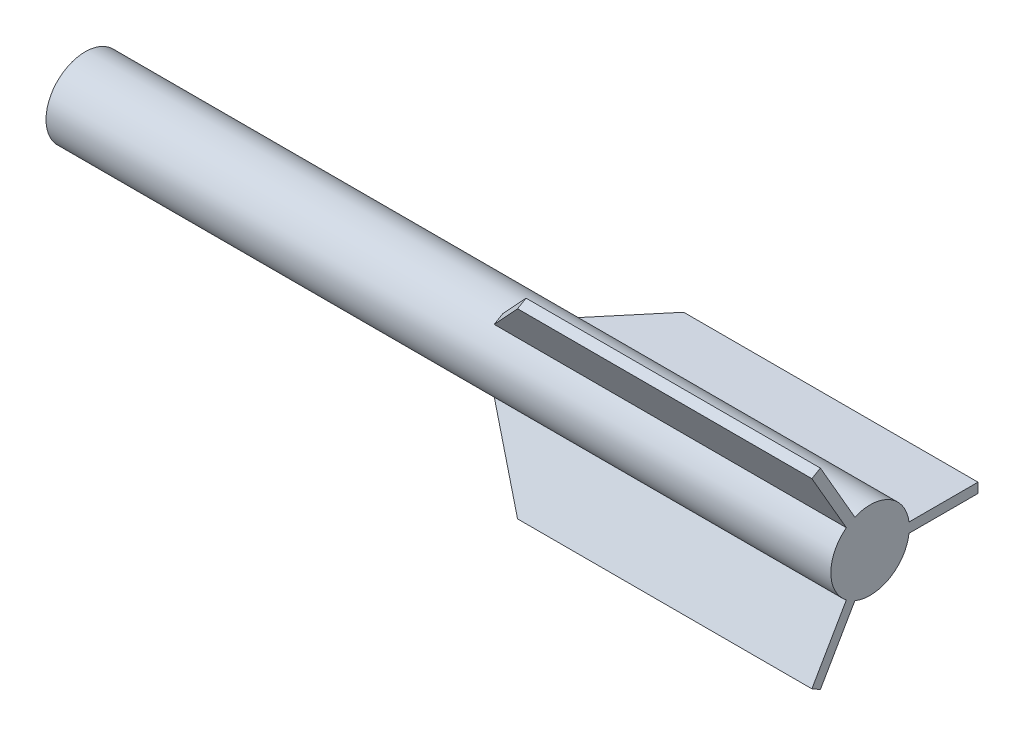
ISO-10303-21;
HEADER;
FILE_DESCRIPTION(('STEP AP214'),'2;1');
FILE_NAME('part.step','',(''),(''),'','','');
FILE_SCHEMA(('AUTOMOTIVE_DESIGN { 1 0 10303 214 1 1 1 1 }'));
ENDSEC;
DATA;
#1=APPLICATION_CONTEXT('core data for automotive mechanical design processes');
#2=APPLICATION_PROTOCOL_DEFINITION('international standard','automotive_design',2000,#1);
#3=PRODUCT_CONTEXT('',#1,'mechanical');
#4=PRODUCT('Part','Part','',(#3));
#5=PRODUCT_RELATED_PRODUCT_CATEGORY('part','',(#4));
#6=PRODUCT_DEFINITION_FORMATION('','',#4);
#7=PRODUCT_DEFINITION_CONTEXT('part definition',#1,'design');
#8=PRODUCT_DEFINITION('design','',#6,#7);
#9=PRODUCT_DEFINITION_SHAPE('','',#8);
#10=(LENGTH_UNIT() NAMED_UNIT(*) SI_UNIT(.MILLI.,.METRE.));
#11=(NAMED_UNIT(*) PLANE_ANGLE_UNIT() SI_UNIT($,.RADIAN.));
#12=(NAMED_UNIT(*) SI_UNIT($,.STERADIAN.) SOLID_ANGLE_UNIT());
#13=UNCERTAINTY_MEASURE_WITH_UNIT(LENGTH_MEASURE(1.E-05),#10,'distance_accuracy_value','');
#14=(GEOMETRIC_REPRESENTATION_CONTEXT(3) GLOBAL_UNCERTAINTY_ASSIGNED_CONTEXT((#13)) GLOBAL_UNIT_ASSIGNED_CONTEXT((#10,
#11,#12)) REPRESENTATION_CONTEXT('',''));
#15=CARTESIAN_POINT('',(0.,0.,0.));
#16=DIRECTION('',(0.,0.,1.));
#17=DIRECTION('',(1.,0.,0.));
#18=AXIS2_PLACEMENT_3D('',#15,#16,#17);
#19=CARTESIAN_POINT('',(94.9963700626207,0.,-20.));
#20=DIRECTION('',(-1.,0.,0.));
#21=DIRECTION('',(0.,0.,1.));
#22=AXIS2_PLACEMENT_3D('',#19,#20,#21);
#23=PLANE('',#22);
#24=CARTESIAN_POINT('',(94.9963700626207,0.,0.));
#25=DIRECTION('',(-1.,0.,0.));
#26=DIRECTION('',(0.,0.,1.));
#27=AXIS2_PLACEMENT_3D('',#24,#25,#26);
#28=CIRCLE('',#27,20.);
#29=CARTESIAN_POINT('',(94.9963700626207,18.4346588560844,7.75650390703121));
#30=VERTEX_POINT('',#29);
#31=CARTESIAN_POINT('',(94.9963700626207,2.5,-19.8431348329844));
#32=VERTEX_POINT('',#31);
#33=EDGE_CURVE('E228',#30,#32,#28,.T.);
#34=ORIENTED_EDGE('',*,*,#33,.F.);
#35=DIRECTION('',(0.,0.866025403784436,0.500000000000004));
#36=VECTOR('',#35,1.);
#37=CARTESIAN_POINT('',(94.9963700626207,-13.4927332971333,-10.676784547152));
#38=LINE('',#37,#36);
#39=CARTESIAN_POINT('',(94.9963700626207,48.881397208144,25.3349364905392));
#40=VERTEX_POINT('',#39);
#41=EDGE_CURVE('E153',#40,#30,#38,.F.);
#42=ORIENTED_EDGE('',*,*,#41,.F.);
#43=DIRECTION('',(0.,0.500000000000004,-0.866025403784436));
#44=VECTOR('',#43,1.);
#45=CARTESIAN_POINT('',(94.9963700626207,47.631397208144,27.5000000000002));
#46=LINE('',#45,#44);
#47=CARTESIAN_POINT('',(94.9963700626207,46.381397208144,29.6650635094613));
#48=VERTEX_POINT('',#47);
#49=EDGE_CURVE('E149',#48,#40,#46,.T.);
#50=ORIENTED_EDGE('',*,*,#49,.F.);
#51=DIRECTION('',(0.,0.866025403784436,0.500000000000004));
#52=VECTOR('',#51,1.);
#53=CARTESIAN_POINT('',(94.9963700626207,-15.9927332971334,-6.34665752822981));
#54=LINE('',#53,#52);
#55=CARTESIAN_POINT('',(94.9963700626207,15.9346588560844,12.0866309259534));
#56=VERTEX_POINT('',#55);
#57=EDGE_CURVE('E137',#48,#56,#54,.F.);
#58=ORIENTED_EDGE('',*,*,#57,.T.);
#59=CARTESIAN_POINT('',(94.9963700626207,-15.9346588560843,12.0866309259534));
#60=VERTEX_POINT('',#59);
#61=EDGE_CURVE('E233',#60,#56,#28,.T.);
#62=ORIENTED_EDGE('',*,*,#61,.F.);
#63=DIRECTION('',(0.,-0.866025403784436,0.500000000000004));
#64=VECTOR('',#63,1.);
#65=CARTESIAN_POINT('',(94.9963700626208,7.58453047896096,-1.49217936775693));
#66=LINE('',#65,#64);
#67=CARTESIAN_POINT('',(94.9963700626208,-46.381397208144,29.6650635094613));
#68=VERTEX_POINT('',#67);
#69=EDGE_CURVE('E175',#68,#60,#66,.F.);
#70=ORIENTED_EDGE('',*,*,#69,.F.);
#71=DIRECTION('',(0.,0.500000000000004,0.866025403784436));
#72=VECTOR('',#71,1.);
#73=CARTESIAN_POINT('',(94.9963700626207,-47.631397208144,27.5000000000002));
#74=LINE('',#73,#72);
#75=CARTESIAN_POINT('',(94.9963700626208,-48.881397208144,25.3349364905391));
#76=VERTEX_POINT('',#75);
#77=EDGE_CURVE('E183',#76,#68,#74,.T.);
#78=ORIENTED_EDGE('',*,*,#77,.F.);
#79=DIRECTION('',(0.,-0.866025403784436,0.500000000000004));
#80=VECTOR('',#79,1.);
#81=CARTESIAN_POINT('',(94.9963700626208,5.08453047896093,-5.82230638667912));
#82=LINE('',#81,#80);
#83=CARTESIAN_POINT('',(94.9963700626208,-18.4346588560844,7.75650390703121));
#84=VERTEX_POINT('',#83);
#85=EDGE_CURVE('E179',#76,#84,#82,.F.);
#86=ORIENTED_EDGE('',*,*,#85,.T.);
#87=CARTESIAN_POINT('',(94.9963700626207,-2.5,-19.8431348329844));
#88=VERTEX_POINT('',#87);
#89=EDGE_CURVE('E229',#88,#84,#28,.T.);
#90=ORIENTED_EDGE('',*,*,#89,.F.);
#91=DIRECTION('',(0.,0.,1.));
#92=VECTOR('',#91,1.);
#93=CARTESIAN_POINT('',(94.9963700626207,-2.5,-0.949587389404511));
#94=LINE('',#93,#92);
#95=CARTESIAN_POINT('',(94.9963700626207,-2.5,-55.));
#96=VERTEX_POINT('',#95);
#97=EDGE_CURVE('E205',#88,#96,#94,.F.);
#98=ORIENTED_EDGE('',*,*,#97,.T.);
#99=DIRECTION('',(0.,1.,0.));
#100=VECTOR('',#99,1.);
#101=CARTESIAN_POINT('',(94.9963700626207,0.,-55.));
#102=LINE('',#101,#100);
#103=CARTESIAN_POINT('',(94.9963700626207,2.5,-55.));
#104=VERTEX_POINT('',#103);
#105=EDGE_CURVE('E224',#96,#104,#102,.T.);
#106=ORIENTED_EDGE('',*,*,#105,.T.);
#107=DIRECTION('',(0.,0.,1.));
#108=VECTOR('',#107,1.);
#109=CARTESIAN_POINT('',(94.9963700626207,2.5,-0.949587389404511));
#110=LINE('',#109,#108);
#111=EDGE_CURVE('E209',#32,#104,#110,.F.);
#112=ORIENTED_EDGE('',*,*,#111,.F.);
#113=EDGE_LOOP('',(#34,#42,#50,#58,#62,#70,#78,#86,#90,#98,#106,#112));
#114=FACE_BOUND('',#113,.T.);
#115=ADVANCED_FACE('F43',(#114),#23,.F.);
#116=CARTESIAN_POINT('',(-305.003629937379,0.,0.));
#117=DIRECTION('',(1.,0.,0.));
#118=DIRECTION('',(0.,0.,-1.));
#119=AXIS2_PLACEMENT_3D('',#116,#117,#118);
#120=PLANE('',#119);
#121=CARTESIAN_POINT('',(-305.003629937379,0.,0.));
#122=DIRECTION('',(-1.,0.,0.));
#123=DIRECTION('',(0.,0.,1.));
#124=AXIS2_PLACEMENT_3D('',#121,#122,#123);
#125=CIRCLE('',#124,17.5);
#126=CARTESIAN_POINT('',(-305.003629937379,0.,17.5));
#127=VERTEX_POINT('',#126);
#128=EDGE_CURVE('E440',#127,#127,#125,.T.);
#129=ORIENTED_EDGE('',*,*,#128,.F.);
#130=EDGE_LOOP('',(#129));
#131=FACE_BOUND('',#130,.T.);
#132=CARTESIAN_POINT('',(-305.003629937379,0.,0.));
#133=DIRECTION('',(-1.,0.,0.));
#134=DIRECTION('',(0.,0.,1.));
#135=AXIS2_PLACEMENT_3D('',#132,#133,#134);
#136=CIRCLE('',#135,20.);
#137=CARTESIAN_POINT('',(-305.003629937379,0.,20.));
#138=VERTEX_POINT('',#137);
#139=EDGE_CURVE('E232',#138,#138,#136,.T.);
#140=ORIENTED_EDGE('',*,*,#139,.T.);
#141=EDGE_LOOP('',(#140));
#142=FACE_BOUND('',#141,.T.);
#143=ADVANCED_FACE('F294',(#131,#142),#120,.F.);
#144=CARTESIAN_POINT('',(-128.010899182561,0.,0.));
#145=DIRECTION('',(-1.,0.,0.));
#146=DIRECTION('',(0.,0.,1.));
#147=AXIS2_PLACEMENT_3D('',#144,#145,#146);
#148=CYLINDRICAL_SURFACE('',#147,20.);
#149=ORIENTED_EDGE('',*,*,#89,.T.);
#150=DIRECTION('',(-1.,0.,0.));
#151=VECTOR('',#150,1.);
#152=CARTESIAN_POINT('',(-128.010899182561,-18.4346588560844,7.75650390703121));
#153=LINE('',#152,#151);
#154=CARTESIAN_POINT('',(-84.5037425323713,-18.4346588560844,7.75650390703121));
#155=VERTEX_POINT('',#154);
#156=EDGE_CURVE('E247',#155,#84,#153,.F.);
#157=ORIENTED_EDGE('',*,*,#156,.F.);
#158=CARTESIAN_POINT('',(-101.15410965213,0.,0.));
#159=DIRECTION('',(-0.766044443118979,-0.556670399226416,0.321393804843271));
#160=DIRECTION('',(-0.642787609686538,0.663413948168938,-0.383022221559493));
#161=AXIS2_PLACEMENT_3D('',#158,#159,#160);
#162=ELLIPSE('',#161,26.1081457866455,20.);
#163=CARTESIAN_POINT('',(-84.5037425323713,-15.9346588560843,12.0866309259534));
#164=VERTEX_POINT('',#163);
#165=EDGE_CURVE('E251',#155,#164,#162,.T.);
#166=ORIENTED_EDGE('',*,*,#165,.T.);
#167=DIRECTION('',(-1.,0.,0.));
#168=VECTOR('',#167,1.);
#169=CARTESIAN_POINT('',(-128.010899182561,-15.9346588560843,12.0866309259534));
#170=LINE('',#169,#168);
#171=EDGE_CURVE('E254',#164,#60,#170,.F.);
#172=ORIENTED_EDGE('',*,*,#171,.T.);
#173=ORIENTED_EDGE('',*,*,#61,.T.);
#174=DIRECTION('',(-1.,0.,0.));
#175=VECTOR('',#174,1.);
#176=CARTESIAN_POINT('',(-128.010899182561,15.9346588560843,12.0866309259534));
#177=LINE('',#176,#175);
#178=CARTESIAN_POINT('',(-84.5037425323713,15.9346588560843,12.0866309259534));
#179=VERTEX_POINT('',#178);
#180=EDGE_CURVE('E61',#179,#56,#177,.F.);
#181=ORIENTED_EDGE('',*,*,#180,.F.);
#182=CARTESIAN_POINT('',(-101.15410965213,0.,0.));
#183=DIRECTION('',(-0.76604444311898,0.556670399226416,0.321393804843271));
#184=DIRECTION('',(-0.642787609686537,-0.663413948168938,-0.383022221559493));
#185=AXIS2_PLACEMENT_3D('',#182,#183,#184);
#186=ELLIPSE('',#185,26.1081457866455,20.);
#187=CARTESIAN_POINT('',(-84.5037425323713,18.4346588560844,7.75650390703121));
#188=VERTEX_POINT('',#187);
#189=EDGE_CURVE('E51',#179,#188,#186,.T.);
#190=ORIENTED_EDGE('',*,*,#189,.T.);
#191=DIRECTION('',(-1.,0.,0.));
#192=VECTOR('',#191,1.);
#193=CARTESIAN_POINT('',(-128.010899182561,18.4346588560844,7.75650390703121));
#194=LINE('',#193,#192);
#195=EDGE_CURVE('E11',#188,#30,#194,.F.);
#196=ORIENTED_EDGE('',*,*,#195,.T.);
#197=ORIENTED_EDGE('',*,*,#33,.T.);
#198=DIRECTION('',(-1.,0.,0.));
#199=VECTOR('',#198,1.);
#200=CARTESIAN_POINT('',(-128.010899182561,2.5,-19.8431348329844));
#201=LINE('',#200,#199);
#202=CARTESIAN_POINT('',(-84.5037425323712,2.5,-19.8431348329844));
#203=VERTEX_POINT('',#202);
#204=EDGE_CURVE('E241',#32,#203,#201,.T.);
#205=ORIENTED_EDGE('',*,*,#204,.T.);
#206=CARTESIAN_POINT('',(-101.154109652129,0.,0.));
#207=DIRECTION('',(-0.76604444311898,0.,-0.642787609686537));
#208=DIRECTION('',(-0.642787609686537,0.,0.76604444311898));
#209=AXIS2_PLACEMENT_3D('',#206,#207,#208);
#210=ELLIPSE('',#209,26.1081457866455,20.);
#211=CARTESIAN_POINT('',(-84.5037425323712,-2.5,-19.8431348329844));
#212=VERTEX_POINT('',#211);
#213=EDGE_CURVE('E238',#203,#212,#210,.T.);
#214=ORIENTED_EDGE('',*,*,#213,.T.);
#215=DIRECTION('',(-1.,0.,0.));
#216=VECTOR('',#215,1.);
#217=CARTESIAN_POINT('',(-128.010899182561,-2.5,-19.8431348329844));
#218=LINE('',#217,#216);
#219=EDGE_CURVE('E237',#88,#212,#218,.T.);
#220=ORIENTED_EDGE('',*,*,#219,.F.);
#221=EDGE_LOOP('',(#149,#157,#166,#172,#173,#181,#190,#196,#197,#205,#214,#220));
#222=FACE_BOUND('',#221,.T.);
#223=ORIENTED_EDGE('',*,*,#139,.F.);
#224=EDGE_LOOP('',(#223));
#225=FACE_BOUND('',#224,.T.);
#226=ADVANCED_FACE('F263',(#222,#225),#148,.T.);
#227=CARTESIAN_POINT('',(-55.0036299373793,0.,-55.));
#228=DIRECTION('',(-0.76604444311898,0.,-0.642787609686537));
#229=DIRECTION('',(-0.642787609686537,0.,0.76604444311898));
#230=AXIS2_PLACEMENT_3D('',#227,#228,#229);
#231=PLANE('',#230);
#232=ORIENTED_EDGE('',*,*,#213,.F.);
#233=DIRECTION('',(-0.642787609686537,0.,0.76604444311898));
#234=VECTOR('',#233,1.);
#235=CARTESIAN_POINT('',(-55.0036299373793,2.5,-55.));
#236=LINE('',#235,#234);
#237=CARTESIAN_POINT('',(-55.0036299373793,2.5,-55.));
#238=VERTEX_POINT('',#237);
#239=EDGE_CURVE('E200',#238,#203,#236,.T.);
#240=ORIENTED_EDGE('',*,*,#239,.F.);
#241=DIRECTION('',(0.,1.,0.));
#242=VECTOR('',#241,1.);
#243=CARTESIAN_POINT('',(-55.0036299373793,0.,-55.));
#244=LINE('',#243,#242);
#245=CARTESIAN_POINT('',(-55.0036299373793,-2.5,-55.));
#246=VERTEX_POINT('',#245);
#247=EDGE_CURVE('E212',#246,#238,#244,.T.);
#248=ORIENTED_EDGE('',*,*,#247,.F.);
#249=DIRECTION('',(-0.642787609686537,0.,0.76604444311898));
#250=VECTOR('',#249,1.);
#251=CARTESIAN_POINT('',(-55.0036299373793,-2.5,-55.));
#252=LINE('',#251,#250);
#253=EDGE_CURVE('E197',#246,#212,#252,.T.);
#254=ORIENTED_EDGE('',*,*,#253,.T.);
#255=EDGE_LOOP('',(#232,#240,#248,#254));
#256=FACE_BOUND('',#255,.T.);
#257=ADVANCED_FACE('F278',(#256),#231,.T.);
#258=CARTESIAN_POINT('',(-102.210177905867,2.5,-0.949587389404511));
#259=DIRECTION('',(0.,1.,0.));
#260=DIRECTION('',(0.,0.,1.));
#261=AXIS2_PLACEMENT_3D('',#258,#259,#260);
#262=PLANE('',#261);
#263=ORIENTED_EDGE('',*,*,#204,.F.);
#264=ORIENTED_EDGE('',*,*,#111,.T.);
#265=DIRECTION('',(1.,0.,0.));
#266=VECTOR('',#265,1.);
#267=CARTESIAN_POINT('',(-102.210177905867,2.5,-55.));
#268=LINE('',#267,#266);
#269=EDGE_CURVE('E204',#104,#238,#268,.F.);
#270=ORIENTED_EDGE('',*,*,#269,.T.);
#271=ORIENTED_EDGE('',*,*,#239,.T.);
#272=EDGE_LOOP('',(#263,#264,#270,#271));
#273=FACE_BOUND('',#272,.T.);
#274=ADVANCED_FACE('F269',(#273),#262,.T.);
#275=CARTESIAN_POINT('',(-102.210177905867,-2.5,-0.949587389404511));
#276=DIRECTION('',(0.,1.,0.));
#277=DIRECTION('',(0.,0.,1.));
#278=AXIS2_PLACEMENT_3D('',#275,#276,#277);
#279=PLANE('',#278);
#280=ORIENTED_EDGE('',*,*,#97,.F.);
#281=ORIENTED_EDGE('',*,*,#219,.T.);
#282=ORIENTED_EDGE('',*,*,#253,.F.);
#283=DIRECTION('',(1.,0.,0.));
#284=VECTOR('',#283,1.);
#285=CARTESIAN_POINT('',(-102.210177905867,-2.5,-55.));
#286=LINE('',#285,#284);
#287=EDGE_CURVE('E216',#96,#246,#286,.F.);
#288=ORIENTED_EDGE('',*,*,#287,.F.);
#289=EDGE_LOOP('',(#280,#281,#282,#288));
#290=FACE_BOUND('',#289,.T.);
#291=ADVANCED_FACE('F282',(#290),#279,.F.);
#292=CARTESIAN_POINT('',(94.9963700626207,0.,-55.));
#293=DIRECTION('',(0.,0.,-1.));
#294=DIRECTION('',(-1.,0.,0.));
#295=AXIS2_PLACEMENT_3D('',#292,#293,#294);
#296=PLANE('',#295);
#297=ORIENTED_EDGE('',*,*,#105,.F.);
#298=ORIENTED_EDGE('',*,*,#287,.T.);
#299=ORIENTED_EDGE('',*,*,#247,.T.);
#300=ORIENTED_EDGE('',*,*,#269,.F.);
#301=EDGE_LOOP('',(#297,#298,#299,#300));
#302=FACE_BOUND('',#301,.T.);
#303=ADVANCED_FACE('F276',(#302),#296,.T.);
#304=CARTESIAN_POINT('',(-84.372117028584,-17.3205080756887,10.0000000000001));
#305=DIRECTION('',(-0.766044443118979,-0.556670399226416,0.321393804843271));
#306=DIRECTION('',(0.642787609686538,-0.663413948168938,0.383022221559493));
#307=AXIS2_PLACEMENT_3D('',#304,#305,#306);
#308=PLANE('',#307);
#309=ORIENTED_EDGE('',*,*,#165,.F.);
#310=DIRECTION('',(0.642787609686538,-0.663413948168938,0.383022221559493));
#311=VECTOR('',#310,1.);
#312=CARTESIAN_POINT('',(-84.372117028584,-18.5705080756887,7.83493649053899));
#313=LINE('',#312,#311);
#314=CARTESIAN_POINT('',(-55.0036299373793,-48.881397208144,25.3349364905391));
#315=VERTEX_POINT('',#314);
#316=EDGE_CURVE('E148',#155,#315,#313,.T.);
#317=ORIENTED_EDGE('',*,*,#316,.T.);
#318=DIRECTION('',(0.,0.500000000000004,0.866025403784436));
#319=VECTOR('',#318,1.);
#320=CARTESIAN_POINT('',(-55.0036299373793,-47.631397208144,27.5000000000002));
#321=LINE('',#320,#319);
#322=CARTESIAN_POINT('',(-55.0036299373793,-46.381397208144,29.6650635094613));
#323=VERTEX_POINT('',#322);
#324=EDGE_CURVE('E193',#315,#323,#321,.T.);
#325=ORIENTED_EDGE('',*,*,#324,.T.);
#326=DIRECTION('',(0.642787609686538,-0.663413948168938,0.383022221559493));
#327=VECTOR('',#326,1.);
#328=CARTESIAN_POINT('',(-84.372117028584,-16.0705080756887,12.1650635094612));
#329=LINE('',#328,#327);
#330=EDGE_CURVE('E176',#164,#323,#329,.T.);
#331=ORIENTED_EDGE('',*,*,#330,.F.);
#332=EDGE_LOOP('',(#309,#317,#325,#331));
#333=FACE_BOUND('',#332,.T.);
#334=ADVANCED_FACE('F289',(#333),#308,.T.);
#335=CARTESIAN_POINT('',(-101.579633398991,7.58453047896096,-1.49217936775693));
#336=DIRECTION('',(0.,0.500000000000004,0.866025403784436));
#337=DIRECTION('',(0.,-0.866025403784436,0.500000000000004));
#338=AXIS2_PLACEMENT_3D('',#335,#336,#337);
#339=PLANE('',#338);
#340=ORIENTED_EDGE('',*,*,#171,.F.);
#341=ORIENTED_EDGE('',*,*,#330,.T.);
#342=DIRECTION('',(1.,0.,0.));
#343=VECTOR('',#342,1.);
#344=CARTESIAN_POINT('',(-101.579633398991,-46.381397208144,29.6650635094613));
#345=LINE('',#344,#343);
#346=EDGE_CURVE('E171',#323,#68,#345,.T.);
#347=ORIENTED_EDGE('',*,*,#346,.T.);
#348=ORIENTED_EDGE('',*,*,#69,.T.);
#349=EDGE_LOOP('',(#340,#341,#347,#348));
#350=FACE_BOUND('',#349,.T.);
#351=ADVANCED_FACE('F334',(#350),#339,.T.);
#352=CARTESIAN_POINT('',(-101.579633398991,5.08453047896093,-5.82230638667912));
#353=DIRECTION('',(0.,0.500000000000004,0.866025403784436));
#354=DIRECTION('',(0.,-0.866025403784436,0.500000000000004));
#355=AXIS2_PLACEMENT_3D('',#352,#353,#354);
#356=PLANE('',#355);
#357=ORIENTED_EDGE('',*,*,#316,.F.);
#358=ORIENTED_EDGE('',*,*,#156,.T.);
#359=ORIENTED_EDGE('',*,*,#85,.F.);
#360=DIRECTION('',(1.,0.,0.));
#361=VECTOR('',#360,1.);
#362=CARTESIAN_POINT('',(-101.579633398991,-48.881397208144,25.3349364905391));
#363=LINE('',#362,#361);
#364=EDGE_CURVE('E184',#315,#76,#363,.T.);
#365=ORIENTED_EDGE('',*,*,#364,.F.);
#366=EDGE_LOOP('',(#357,#358,#359,#365));
#367=FACE_BOUND('',#366,.T.);
#368=ADVANCED_FACE('F344',(#367),#356,.F.);
#369=CARTESIAN_POINT('',(94.9963700626207,-47.631397208144,27.5000000000002));
#370=DIRECTION('',(0.,-0.866025403784436,0.500000000000004));
#371=DIRECTION('',(1.,0.,0.));
#372=AXIS2_PLACEMENT_3D('',#369,#370,#371);
#373=PLANE('',#372);
#374=ORIENTED_EDGE('',*,*,#324,.F.);
#375=ORIENTED_EDGE('',*,*,#364,.T.);
#376=ORIENTED_EDGE('',*,*,#77,.T.);
#377=ORIENTED_EDGE('',*,*,#346,.F.);
#378=EDGE_LOOP('',(#374,#375,#376,#377));
#379=FACE_BOUND('',#378,.T.);
#380=ADVANCED_FACE('F354',(#379),#373,.T.);
#381=CARTESIAN_POINT('',(-84.372117028584,17.3205080756887,10.0000000000001));
#382=DIRECTION('',(-0.76604444311898,0.556670399226416,0.321393804843271));
#383=DIRECTION('',(0.642787609686537,0.663413948168938,0.383022221559493));
#384=AXIS2_PLACEMENT_3D('',#381,#382,#383);
#385=PLANE('',#384);
#386=ORIENTED_EDGE('',*,*,#189,.F.);
#387=DIRECTION('',(0.642787609686537,0.663413948168938,0.383022221559493));
#388=VECTOR('',#387,1.);
#389=CARTESIAN_POINT('',(-84.372117028584,16.0705080756887,12.1650635094612));
#390=LINE('',#389,#388);
#391=CARTESIAN_POINT('',(-55.0036299373793,46.381397208144,29.6650635094613));
#392=VERTEX_POINT('',#391);
#393=EDGE_CURVE('E143',#179,#392,#390,.T.);
#394=ORIENTED_EDGE('',*,*,#393,.T.);
#395=DIRECTION('',(0.,0.500000000000004,-0.866025403784436));
#396=VECTOR('',#395,1.);
#397=CARTESIAN_POINT('',(-55.0036299373793,47.631397208144,27.5000000000002));
#398=LINE('',#397,#396);
#399=CARTESIAN_POINT('',(-55.0036299373793,48.8813972081441,25.3349364905392));
#400=VERTEX_POINT('',#399);
#401=EDGE_CURVE('E140',#392,#400,#398,.T.);
#402=ORIENTED_EDGE('',*,*,#401,.T.);
#403=DIRECTION('',(0.642787609686537,0.663413948168938,0.383022221559493));
#404=VECTOR('',#403,1.);
#405=CARTESIAN_POINT('',(-84.372117028584,18.5705080756887,7.834936490539));
#406=LINE('',#405,#404);
#407=EDGE_CURVE('E128',#188,#400,#406,.T.);
#408=ORIENTED_EDGE('',*,*,#407,.F.);
#409=EDGE_LOOP('',(#386,#394,#402,#408));
#410=FACE_BOUND('',#409,.T.);
#411=ADVANCED_FACE('F141',(#410),#385,.T.);
#412=CARTESIAN_POINT('',(-101.44722523944,-13.4927332971333,-10.676784547152));
#413=DIRECTION('',(0.,0.500000000000004,-0.866025403784436));
#414=DIRECTION('',(0.,0.866025403784436,0.500000000000004));
#415=AXIS2_PLACEMENT_3D('',#412,#413,#414);
#416=PLANE('',#415);
#417=ORIENTED_EDGE('',*,*,#195,.F.);
#418=ORIENTED_EDGE('',*,*,#407,.T.);
#419=DIRECTION('',(1.,0.,0.));
#420=VECTOR('',#419,1.);
#421=CARTESIAN_POINT('',(-101.44722523944,48.8813972081441,25.3349364905392));
#422=LINE('',#421,#420);
#423=EDGE_CURVE('E133',#400,#40,#422,.T.);
#424=ORIENTED_EDGE('',*,*,#423,.T.);
#425=ORIENTED_EDGE('',*,*,#41,.T.);
#426=EDGE_LOOP('',(#417,#418,#424,#425));
#427=FACE_BOUND('',#426,.T.);
#428=ADVANCED_FACE('F130',(#427),#416,.T.);
#429=CARTESIAN_POINT('',(-101.44722523944,-15.9927332971334,-6.34665752822981));
#430=DIRECTION('',(0.,0.500000000000004,-0.866025403784436));
#431=DIRECTION('',(0.,0.866025403784436,0.500000000000004));
#432=AXIS2_PLACEMENT_3D('',#429,#430,#431);
#433=PLANE('',#432);
#434=ORIENTED_EDGE('',*,*,#393,.F.);
#435=ORIENTED_EDGE('',*,*,#180,.T.);
#436=ORIENTED_EDGE('',*,*,#57,.F.);
#437=DIRECTION('',(1.,0.,0.));
#438=VECTOR('',#437,1.);
#439=CARTESIAN_POINT('',(-101.44722523944,46.381397208144,29.6650635094613));
#440=LINE('',#439,#438);
#441=EDGE_CURVE('E161',#392,#48,#440,.T.);
#442=ORIENTED_EDGE('',*,*,#441,.F.);
#443=EDGE_LOOP('',(#434,#435,#436,#442));
#444=FACE_BOUND('',#443,.T.);
#445=ADVANCED_FACE('F391',(#444),#433,.F.);
#446=CARTESIAN_POINT('',(94.9963700626207,47.631397208144,27.5000000000002));
#447=DIRECTION('',(0.,0.866025403784436,0.500000000000004));
#448=DIRECTION('',(1.,0.,0.));
#449=AXIS2_PLACEMENT_3D('',#446,#447,#448);
#450=PLANE('',#449);
#451=ORIENTED_EDGE('',*,*,#401,.F.);
#452=ORIENTED_EDGE('',*,*,#441,.T.);
#453=ORIENTED_EDGE('',*,*,#49,.T.);
#454=ORIENTED_EDGE('',*,*,#423,.F.);
#455=EDGE_LOOP('',(#451,#452,#453,#454));
#456=FACE_BOUND('',#455,.T.);
#457=ADVANCED_FACE('F151',(#456),#450,.T.);
#458=CARTESIAN_POINT('',(-105.003629937379,0.,0.));
#459=DIRECTION('',(1.,0.,0.));
#460=DIRECTION('',(0.,0.,-1.));
#461=AXIS2_PLACEMENT_3D('',#458,#459,#460);
#462=PLANE('',#461);
#463=CARTESIAN_POINT('',(-105.003629937379,0.,0.));
#464=DIRECTION('',(-1.,0.,0.));
#465=DIRECTION('',(0.,0.,1.));
#466=AXIS2_PLACEMENT_3D('',#463,#464,#465);
#467=CIRCLE('',#466,17.5);
#468=CARTESIAN_POINT('',(-105.003629937379,0.,17.5));
#469=VERTEX_POINT('',#468);
#470=EDGE_CURVE('E158',#469,#469,#467,.T.);
#471=ORIENTED_EDGE('',*,*,#470,.T.);
#472=EDGE_LOOP('',(#471));
#473=FACE_BOUND('',#472,.T.);
#474=ADVANCED_FACE('F408',(#473),#462,.F.);
#475=CARTESIAN_POINT('',(-305.003629937379,0.,0.));
#476=DIRECTION('',(-1.,0.,0.));
#477=DIRECTION('',(0.,0.,1.));
#478=AXIS2_PLACEMENT_3D('',#475,#476,#477);
#479=CYLINDRICAL_SURFACE('',#478,17.5);
#480=ORIENTED_EDGE('',*,*,#470,.F.);
#481=EDGE_LOOP('',(#480));
#482=FACE_BOUND('',#481,.T.);
#483=ORIENTED_EDGE('',*,*,#128,.T.);
#484=EDGE_LOOP('',(#483));
#485=FACE_BOUND('',#484,.T.);
#486=ADVANCED_FACE('F422',(#482,#485),#479,.F.);
#487=CLOSED_SHELL('',(#115,#143,#226,#257,#274,#291,#303,#334,#351,#368,#380,#411,#428,#445,
#457,#474,#486));
#488=MANIFOLD_SOLID_BREP('B2',#487);
#489=ADVANCED_BREP_SHAPE_REPRESENTATION('',(#18,#488),#14);
#490=SHAPE_DEFINITION_REPRESENTATION(#9,#489);
ENDSEC;
END-ISO-10303-21;
